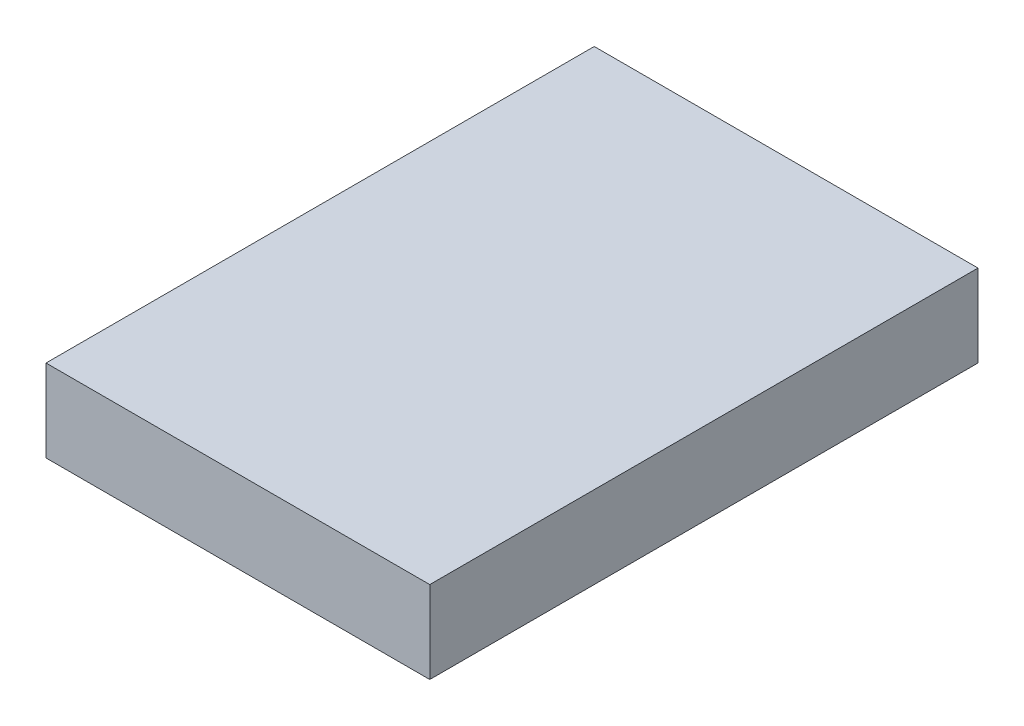
ISO-10303-21;
HEADER;
FILE_DESCRIPTION(('STEP AP214'),'2;1');
FILE_NAME('part.step','',(''),(''),'','','');
FILE_SCHEMA(('AUTOMOTIVE_DESIGN { 1 0 10303 214 1 1 1 1 }'));
ENDSEC;
DATA;
#1=APPLICATION_CONTEXT('core data for automotive mechanical design processes');
#2=APPLICATION_PROTOCOL_DEFINITION('international standard','automotive_design',2000,#1);
#3=PRODUCT_CONTEXT('',#1,'mechanical');
#4=PRODUCT('Part','Part','',(#3));
#5=PRODUCT_RELATED_PRODUCT_CATEGORY('part','',(#4));
#6=PRODUCT_DEFINITION_FORMATION('','',#4);
#7=PRODUCT_DEFINITION_CONTEXT('part definition',#1,'design');
#8=PRODUCT_DEFINITION('design','',#6,#7);
#9=PRODUCT_DEFINITION_SHAPE('','',#8);
#10=(LENGTH_UNIT() NAMED_UNIT(*) SI_UNIT(.MILLI.,.METRE.));
#11=(NAMED_UNIT(*) PLANE_ANGLE_UNIT() SI_UNIT($,.RADIAN.));
#12=(NAMED_UNIT(*) SI_UNIT($,.STERADIAN.) SOLID_ANGLE_UNIT());
#13=UNCERTAINTY_MEASURE_WITH_UNIT(LENGTH_MEASURE(1.E-05),#10,'distance_accuracy_value','');
#14=(GEOMETRIC_REPRESENTATION_CONTEXT(3) GLOBAL_UNCERTAINTY_ASSIGNED_CONTEXT((#13)) GLOBAL_UNIT_ASSIGNED_CONTEXT((#10,
#11,#12)) REPRESENTATION_CONTEXT('',''));
#15=CARTESIAN_POINT('',(0.,0.,0.));
#16=DIRECTION('',(0.,0.,1.));
#17=DIRECTION('',(1.,0.,0.));
#18=AXIS2_PLACEMENT_3D('',#15,#16,#17);
#19=CARTESIAN_POINT('',(35.,15.,50.));
#20=DIRECTION('',(-1.,0.,0.));
#21=DIRECTION('',(0.,0.,1.));
#22=AXIS2_PLACEMENT_3D('',#19,#20,#21);
#23=PLANE('',#22);
#24=DIRECTION('',(0.,0.,-1.));
#25=VECTOR('',#24,1.);
#26=CARTESIAN_POINT('',(35.,0.,50.));
#27=LINE('',#26,#25);
#28=CARTESIAN_POINT('',(35.,0.,50.));
#29=VERTEX_POINT('',#28);
#30=CARTESIAN_POINT('',(35.,0.,-50.));
#31=VERTEX_POINT('',#30);
#32=EDGE_CURVE('E96',#29,#31,#27,.T.);
#33=ORIENTED_EDGE('',*,*,#32,.T.);
#34=DIRECTION('',(0.,-1.,0.));
#35=VECTOR('',#34,1.);
#36=CARTESIAN_POINT('',(35.,15.,-50.));
#37=LINE('',#36,#35);
#38=CARTESIAN_POINT('',(35.,15.,-50.));
#39=VERTEX_POINT('',#38);
#40=EDGE_CURVE('E11',#39,#31,#37,.T.);
#41=ORIENTED_EDGE('',*,*,#40,.F.);
#42=DIRECTION('',(0.,0.,-1.));
#43=VECTOR('',#42,1.);
#44=CARTESIAN_POINT('',(35.,15.,50.));
#45=LINE('',#44,#43);
#46=CARTESIAN_POINT('',(35.,15.,50.));
#47=VERTEX_POINT('',#46);
#48=EDGE_CURVE('E84',#47,#39,#45,.T.);
#49=ORIENTED_EDGE('',*,*,#48,.F.);
#50=DIRECTION('',(0.,-1.,0.));
#51=VECTOR('',#50,1.);
#52=CARTESIAN_POINT('',(35.,15.,50.));
#53=LINE('',#52,#51);
#54=EDGE_CURVE('E92',#47,#29,#53,.T.);
#55=ORIENTED_EDGE('',*,*,#54,.T.);
#56=EDGE_LOOP('',(#33,#41,#49,#55));
#57=FACE_BOUND('',#56,.T.);
#58=ADVANCED_FACE('F33',(#57),#23,.F.);
#59=CARTESIAN_POINT('',(-35.,15.,-50.));
#60=DIRECTION('',(0.,0.,1.));
#61=DIRECTION('',(1.,0.,0.));
#62=AXIS2_PLACEMENT_3D('',#59,#60,#61);
#63=PLANE('',#62);
#64=DIRECTION('',(-1.,0.,0.));
#65=VECTOR('',#64,1.);
#66=CARTESIAN_POINT('',(-35.,0.,-50.));
#67=LINE('',#66,#65);
#68=CARTESIAN_POINT('',(-35.,0.,-50.));
#69=VERTEX_POINT('',#68);
#70=EDGE_CURVE('E88',#31,#69,#67,.T.);
#71=ORIENTED_EDGE('',*,*,#70,.T.);
#72=DIRECTION('',(0.,-1.,0.));
#73=VECTOR('',#72,1.);
#74=CARTESIAN_POINT('',(-35.,15.,-50.));
#75=LINE('',#74,#73);
#76=CARTESIAN_POINT('',(-35.,15.,-50.));
#77=VERTEX_POINT('',#76);
#78=EDGE_CURVE('E41',#77,#69,#75,.T.);
#79=ORIENTED_EDGE('',*,*,#78,.F.);
#80=DIRECTION('',(-1.,0.,0.));
#81=VECTOR('',#80,1.);
#82=CARTESIAN_POINT('',(-35.,15.,-50.));
#83=LINE('',#82,#81);
#84=EDGE_CURVE('E79',#39,#77,#83,.T.);
#85=ORIENTED_EDGE('',*,*,#84,.F.);
#86=ORIENTED_EDGE('',*,*,#40,.T.);
#87=EDGE_LOOP('',(#71,#79,#85,#86));
#88=FACE_BOUND('',#87,.T.);
#89=ADVANCED_FACE('F87',(#88),#63,.F.);
#90=CARTESIAN_POINT('',(-35.,15.,50.));
#91=DIRECTION('',(1.,0.,0.));
#92=DIRECTION('',(0.,0.,-1.));
#93=AXIS2_PLACEMENT_3D('',#90,#91,#92);
#94=PLANE('',#93);
#95=DIRECTION('',(0.,0.,1.));
#96=VECTOR('',#95,1.);
#97=CARTESIAN_POINT('',(-35.,0.,50.));
#98=LINE('',#97,#96);
#99=CARTESIAN_POINT('',(-35.,0.,50.));
#100=VERTEX_POINT('',#99);
#101=EDGE_CURVE('E66',#69,#100,#98,.T.);
#102=ORIENTED_EDGE('',*,*,#101,.T.);
#103=DIRECTION('',(0.,-1.,0.));
#104=VECTOR('',#103,1.);
#105=CARTESIAN_POINT('',(-35.,15.,50.));
#106=LINE('',#105,#104);
#107=CARTESIAN_POINT('',(-35.,15.,50.));
#108=VERTEX_POINT('',#107);
#109=EDGE_CURVE('E89',#108,#100,#106,.T.);
#110=ORIENTED_EDGE('',*,*,#109,.F.);
#111=DIRECTION('',(0.,0.,1.));
#112=VECTOR('',#111,1.);
#113=CARTESIAN_POINT('',(-35.,15.,50.));
#114=LINE('',#113,#112);
#115=EDGE_CURVE('E82',#77,#108,#114,.T.);
#116=ORIENTED_EDGE('',*,*,#115,.F.);
#117=ORIENTED_EDGE('',*,*,#78,.T.);
#118=EDGE_LOOP('',(#102,#110,#116,#117));
#119=FACE_BOUND('',#118,.T.);
#120=ADVANCED_FACE('F90',(#119),#94,.F.);
#121=CARTESIAN_POINT('',(-35.,15.,50.));
#122=DIRECTION('',(0.,0.,-1.));
#123=DIRECTION('',(-1.,0.,0.));
#124=AXIS2_PLACEMENT_3D('',#121,#122,#123);
#125=PLANE('',#124);
#126=DIRECTION('',(1.,0.,0.));
#127=VECTOR('',#126,1.);
#128=CARTESIAN_POINT('',(-35.,0.,50.));
#129=LINE('',#128,#127);
#130=EDGE_CURVE('E72',#100,#29,#129,.T.);
#131=ORIENTED_EDGE('',*,*,#130,.T.);
#132=ORIENTED_EDGE('',*,*,#54,.F.);
#133=DIRECTION('',(1.,0.,0.));
#134=VECTOR('',#133,1.);
#135=CARTESIAN_POINT('',(-35.,15.,50.));
#136=LINE('',#135,#134);
#137=EDGE_CURVE('E49',#108,#47,#136,.T.);
#138=ORIENTED_EDGE('',*,*,#137,.F.);
#139=ORIENTED_EDGE('',*,*,#109,.T.);
#140=EDGE_LOOP('',(#131,#132,#138,#139));
#141=FACE_BOUND('',#140,.T.);
#142=ADVANCED_FACE('F103',(#141),#125,.F.);
#143=CARTESIAN_POINT('',(0.,15.,0.));
#144=DIRECTION('',(0.,-1.,0.));
#145=DIRECTION('',(0.,0.,-1.));
#146=AXIS2_PLACEMENT_3D('',#143,#144,#145);
#147=PLANE('',#146);
#148=ORIENTED_EDGE('',*,*,#48,.T.);
#149=ORIENTED_EDGE('',*,*,#84,.T.);
#150=ORIENTED_EDGE('',*,*,#115,.T.);
#151=ORIENTED_EDGE('',*,*,#137,.T.);
#152=EDGE_LOOP('',(#148,#149,#150,#151));
#153=FACE_BOUND('',#152,.T.);
#154=ADVANCED_FACE('F80',(#153),#147,.F.);
#155=CARTESIAN_POINT('',(0.,0.,0.));
#156=DIRECTION('',(0.,-1.,0.));
#157=DIRECTION('',(0.,0.,-1.));
#158=AXIS2_PLACEMENT_3D('',#155,#156,#157);
#159=PLANE('',#158);
#160=ORIENTED_EDGE('',*,*,#32,.F.);
#161=ORIENTED_EDGE('',*,*,#130,.F.);
#162=ORIENTED_EDGE('',*,*,#101,.F.);
#163=ORIENTED_EDGE('',*,*,#70,.F.);
#164=EDGE_LOOP('',(#160,#161,#162,#163));
#165=FACE_BOUND('',#164,.T.);
#166=ADVANCED_FACE('F106',(#165),#159,.T.);
#167=CLOSED_SHELL('',(#58,#89,#120,#142,#154,#166));
#168=MANIFOLD_SOLID_BREP('B2',#167);
#169=ADVANCED_BREP_SHAPE_REPRESENTATION('',(#18,#168),#14);
#170=SHAPE_DEFINITION_REPRESENTATION(#9,#169);
ENDSEC;
END-ISO-10303-21;
